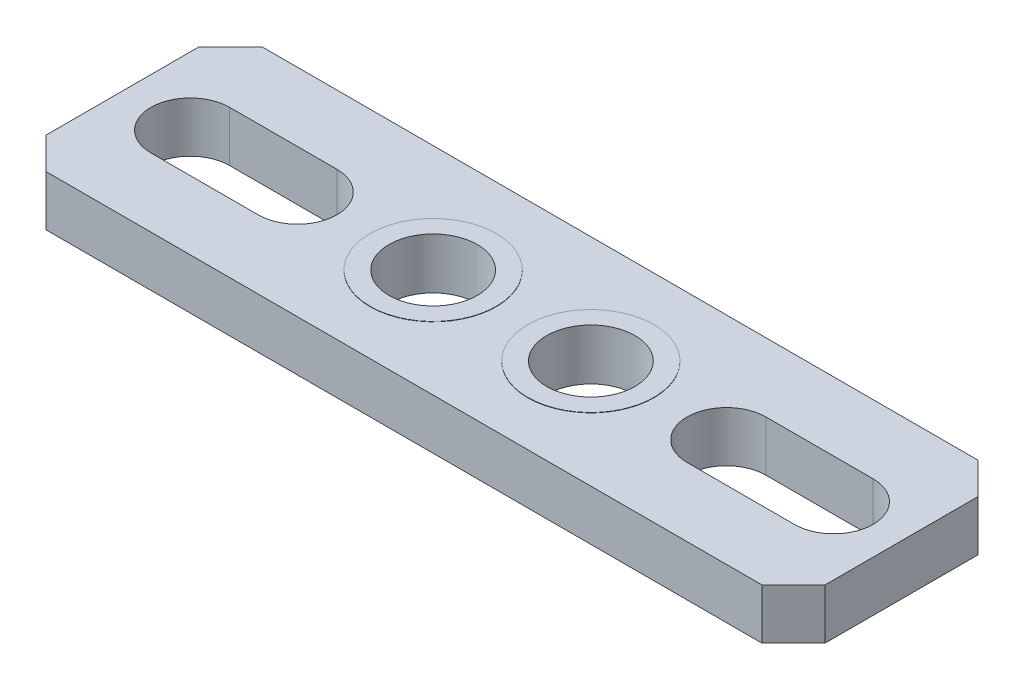
ISO-10303-21;
HEADER;
FILE_DESCRIPTION(('STEP AP214'),'2;1');
FILE_NAME('part.step','',(''),(''),'','','');
FILE_SCHEMA(('AUTOMOTIVE_DESIGN { 1 0 10303 214 1 1 1 1 }'));
ENDSEC;
DATA;
#1=APPLICATION_CONTEXT('core data for automotive mechanical design processes');
#2=APPLICATION_PROTOCOL_DEFINITION('international standard','automotive_design',2000,#1);
#3=PRODUCT_CONTEXT('',#1,'mechanical');
#4=PRODUCT('Part','Part','',(#3));
#5=PRODUCT_RELATED_PRODUCT_CATEGORY('part','',(#4));
#6=PRODUCT_DEFINITION_FORMATION('','',#4);
#7=PRODUCT_DEFINITION_CONTEXT('part definition',#1,'design');
#8=PRODUCT_DEFINITION('design','',#6,#7);
#9=PRODUCT_DEFINITION_SHAPE('','',#8);
#10=(LENGTH_UNIT() NAMED_UNIT(*) SI_UNIT(.MILLI.,.METRE.));
#11=(NAMED_UNIT(*) PLANE_ANGLE_UNIT() SI_UNIT($,.RADIAN.));
#12=(NAMED_UNIT(*) SI_UNIT($,.STERADIAN.) SOLID_ANGLE_UNIT());
#13=UNCERTAINTY_MEASURE_WITH_UNIT(LENGTH_MEASURE(1.E-05),#10,'distance_accuracy_value','');
#14=(GEOMETRIC_REPRESENTATION_CONTEXT(3) GLOBAL_UNCERTAINTY_ASSIGNED_CONTEXT((#13)) GLOBAL_UNIT_ASSIGNED_CONTEXT((#10,
#11,#12)) REPRESENTATION_CONTEXT('',''));
#15=CARTESIAN_POINT('',(0.,0.,0.));
#16=DIRECTION('',(0.,0.,1.));
#17=DIRECTION('',(1.,0.,0.));
#18=AXIS2_PLACEMENT_3D('',#15,#16,#17);
#19=CARTESIAN_POINT('',(0.,0.8,0.));
#20=DIRECTION('',(0.,1.,0.));
#21=DIRECTION('',(0.,0.,1.));
#22=AXIS2_PLACEMENT_3D('',#19,#20,#21);
#23=PLANE('',#22);
#24=CARTESIAN_POINT('',(-2.5,0.8,0.));
#25=DIRECTION('',(0.,1.,0.));
#26=DIRECTION('',(0.,0.,1.));
#27=AXIS2_PLACEMENT_3D('',#24,#25,#26);
#28=CIRCLE('',#27,2.);
#29=CARTESIAN_POINT('',(-2.5,0.8,2.));
#30=VERTEX_POINT('',#29);
#31=EDGE_CURVE('E700',#30,#30,#28,.T.);
#32=ORIENTED_EDGE('',*,*,#31,.F.);
#33=EDGE_LOOP('',(#32));
#34=FACE_BOUND('',#33,.T.);
#35=DIRECTION('',(-1.,0.,0.));
#36=VECTOR('',#35,1.);
#37=CARTESIAN_POINT('',(-12.35,0.8,-3.425));
#38=LINE('',#37,#36);
#39=CARTESIAN_POINT('',(11.35,0.8,-3.425));
#40=VERTEX_POINT('',#39);
#41=CARTESIAN_POINT('',(-11.35,0.8,-3.425));
#42=VERTEX_POINT('',#41);
#43=EDGE_CURVE('E259',#40,#42,#38,.T.);
#44=ORIENTED_EDGE('',*,*,#43,.T.);
#45=DIRECTION('',(0.707106781186549,0.,-0.707106781186546));
#46=VECTOR('',#45,1.);
#47=CARTESIAN_POINT('',(-7.38749999999997,0.8,-7.3875));
#48=LINE('',#47,#46);
#49=CARTESIAN_POINT('',(-12.35,0.8,-2.425));
#50=VERTEX_POINT('',#49);
#51=EDGE_CURVE('E317',#42,#50,#48,.F.);
#52=ORIENTED_EDGE('',*,*,#51,.T.);
#53=DIRECTION('',(0.,0.,1.));
#54=VECTOR('',#53,1.);
#55=CARTESIAN_POINT('',(-12.35,0.8,-3.425));
#56=LINE('',#55,#54);
#57=CARTESIAN_POINT('',(-12.35,0.8,2.42499999999999));
#58=VERTEX_POINT('',#57);
#59=EDGE_CURVE('E264',#50,#58,#56,.T.);
#60=ORIENTED_EDGE('',*,*,#59,.T.);
#61=DIRECTION('',(-0.707106781186546,0.,-0.707106781186549));
#62=VECTOR('',#61,1.);
#63=CARTESIAN_POINT('',(-7.38750000000002,0.8,7.38749999999999));
#64=LINE('',#63,#62);
#65=CARTESIAN_POINT('',(-11.35,0.8,3.425));
#66=VERTEX_POINT('',#65);
#67=EDGE_CURVE('E62',#58,#66,#64,.F.);
#68=ORIENTED_EDGE('',*,*,#67,.T.);
#69=DIRECTION('',(1.,0.,0.));
#70=VECTOR('',#69,1.);
#71=CARTESIAN_POINT('',(-12.35,0.8,3.425));
#72=LINE('',#71,#70);
#73=CARTESIAN_POINT('',(11.35,0.8,3.425));
#74=VERTEX_POINT('',#73);
#75=EDGE_CURVE('E267',#66,#74,#72,.T.);
#76=ORIENTED_EDGE('',*,*,#75,.T.);
#77=DIRECTION('',(-0.707106781186549,0.,0.707106781186546));
#78=VECTOR('',#77,1.);
#79=CARTESIAN_POINT('',(7.38749999999998,0.8,7.38750000000001));
#80=LINE('',#79,#78);
#81=CARTESIAN_POINT('',(12.35,0.8,2.425));
#82=VERTEX_POINT('',#81);
#83=EDGE_CURVE('E311',#74,#82,#80,.F.);
#84=ORIENTED_EDGE('',*,*,#83,.T.);
#85=DIRECTION('',(0.,0.,-1.));
#86=VECTOR('',#85,1.);
#87=CARTESIAN_POINT('',(12.35,0.8,-3.425));
#88=LINE('',#87,#86);
#89=CARTESIAN_POINT('',(12.35,0.8,-2.425));
#90=VERTEX_POINT('',#89);
#91=EDGE_CURVE('E255',#82,#90,#88,.T.);
#92=ORIENTED_EDGE('',*,*,#91,.T.);
#93=DIRECTION('',(0.707106781186546,0.,0.707106781186549));
#94=VECTOR('',#93,1.);
#95=CARTESIAN_POINT('',(7.38750000000002,0.8,-7.38749999999999));
#96=LINE('',#95,#94);
#97=EDGE_CURVE('E314',#90,#40,#96,.F.);
#98=ORIENTED_EDGE('',*,*,#97,.T.);
#99=EDGE_LOOP('',(#44,#52,#60,#68,#76,#84,#92,#98));
#100=FACE_BOUND('',#99,.T.);
#101=DIRECTION('',(1.,0.,0.));
#102=VECTOR('',#101,1.);
#103=CARTESIAN_POINT('',(-10.2,0.8,1.25));
#104=LINE('',#103,#102);
#105=CARTESIAN_POINT('',(-10.2,0.8,1.25));
#106=VERTEX_POINT('',#105);
#107=CARTESIAN_POINT('',(-6.8,0.8,1.25));
#108=VERTEX_POINT('',#107);
#109=EDGE_CURVE('E215',#106,#108,#104,.T.);
#110=ORIENTED_EDGE('',*,*,#109,.F.);
#111=CARTESIAN_POINT('',(-10.2,0.8,0.));
#112=DIRECTION('',(0.,1.,0.));
#113=DIRECTION('',(0.,0.,1.));
#114=AXIS2_PLACEMENT_3D('',#111,#112,#113);
#115=CIRCLE('',#114,1.25);
#116=CARTESIAN_POINT('',(-10.2,0.8,-1.25));
#117=VERTEX_POINT('',#116);
#118=EDGE_CURVE('E212',#117,#106,#115,.T.);
#119=ORIENTED_EDGE('',*,*,#118,.F.);
#120=DIRECTION('',(-1.,0.,0.));
#121=VECTOR('',#120,1.);
#122=CARTESIAN_POINT('',(-10.2,0.8,-1.25));
#123=LINE('',#122,#121);
#124=CARTESIAN_POINT('',(-6.8,0.8,-1.25));
#125=VERTEX_POINT('',#124);
#126=EDGE_CURVE('E223',#125,#117,#123,.T.);
#127=ORIENTED_EDGE('',*,*,#126,.F.);
#128=CARTESIAN_POINT('',(-6.8,0.8,0.));
#129=DIRECTION('',(0.,1.,0.));
#130=DIRECTION('',(0.,0.,1.));
#131=AXIS2_PLACEMENT_3D('',#128,#129,#130);
#132=CIRCLE('',#131,1.25);
#133=EDGE_CURVE('E219',#108,#125,#132,.T.);
#134=ORIENTED_EDGE('',*,*,#133,.F.);
#135=EDGE_LOOP('',(#110,#119,#127,#134));
#136=FACE_BOUND('',#135,.T.);
#137=DIRECTION('',(-1.,0.,0.));
#138=VECTOR('',#137,1.);
#139=CARTESIAN_POINT('',(10.2,0.8,-1.25));
#140=LINE('',#139,#138);
#141=CARTESIAN_POINT('',(10.2,0.8,-1.25));
#142=VERTEX_POINT('',#141);
#143=CARTESIAN_POINT('',(6.80000000000001,0.8,-1.25));
#144=VERTEX_POINT('',#143);
#145=EDGE_CURVE('E167',#142,#144,#140,.T.);
#146=ORIENTED_EDGE('',*,*,#145,.F.);
#147=CARTESIAN_POINT('',(10.2,0.8,0.));
#148=DIRECTION('',(0.,1.,0.));
#149=DIRECTION('',(0.,0.,-1.));
#150=AXIS2_PLACEMENT_3D('',#147,#148,#149);
#151=CIRCLE('',#150,1.25);
#152=CARTESIAN_POINT('',(10.2,0.8,1.25));
#153=VERTEX_POINT('',#152);
#154=EDGE_CURVE('E156',#153,#142,#151,.T.);
#155=ORIENTED_EDGE('',*,*,#154,.F.);
#156=DIRECTION('',(1.,0.,0.));
#157=VECTOR('',#156,1.);
#158=CARTESIAN_POINT('',(10.2,0.8,1.25));
#159=LINE('',#158,#157);
#160=CARTESIAN_POINT('',(6.80000000000001,0.8,1.25));
#161=VERTEX_POINT('',#160);
#162=EDGE_CURVE('E186',#161,#153,#159,.T.);
#163=ORIENTED_EDGE('',*,*,#162,.F.);
#164=CARTESIAN_POINT('',(6.80000000000001,0.8,0.));
#165=DIRECTION('',(0.,1.,0.));
#166=DIRECTION('',(0.,0.,-1.));
#167=AXIS2_PLACEMENT_3D('',#164,#165,#166);
#168=CIRCLE('',#167,1.25);
#169=EDGE_CURVE('E182',#144,#161,#168,.T.);
#170=ORIENTED_EDGE('',*,*,#169,.F.);
#171=EDGE_LOOP('',(#146,#155,#163,#170));
#172=FACE_BOUND('',#171,.T.);
#173=CARTESIAN_POINT('',(2.50000000000001,0.8,0.));
#174=DIRECTION('',(0.,1.,0.));
#175=DIRECTION('',(0.,0.,1.));
#176=AXIS2_PLACEMENT_3D('',#173,#174,#175);
#177=CIRCLE('',#176,2.);
#178=CARTESIAN_POINT('',(2.50000000000001,0.8,2.));
#179=VERTEX_POINT('',#178);
#180=EDGE_CURVE('E688',#179,#179,#177,.T.);
#181=ORIENTED_EDGE('',*,*,#180,.F.);
#182=EDGE_LOOP('',(#181));
#183=FACE_BOUND('',#182,.T.);
#184=ADVANCED_FACE('F41',(#34,#100,#136,#172,#183),#23,.T.);
#185=CARTESIAN_POINT('',(0.,-0.8,0.));
#186=DIRECTION('',(0.,1.,0.));
#187=DIRECTION('',(0.,0.,1.));
#188=AXIS2_PLACEMENT_3D('',#185,#186,#187);
#189=PLANE('',#188);
#190=CARTESIAN_POINT('',(2.50000000000001,-0.8,0.));
#191=DIRECTION('',(0.,1.,0.));
#192=DIRECTION('',(0.,0.,1.));
#193=AXIS2_PLACEMENT_3D('',#190,#191,#192);
#194=CIRCLE('',#193,2.);
#195=CARTESIAN_POINT('',(2.50000000000001,-0.8,2.));
#196=VERTEX_POINT('',#195);
#197=EDGE_CURVE('E666',#196,#196,#194,.T.);
#198=ORIENTED_EDGE('',*,*,#197,.T.);
#199=EDGE_LOOP('',(#198));
#200=FACE_BOUND('',#199,.T.);
#201=CARTESIAN_POINT('',(-2.5,-0.8,0.));
#202=DIRECTION('',(0.,1.,0.));
#203=DIRECTION('',(0.,0.,1.));
#204=AXIS2_PLACEMENT_3D('',#201,#202,#203);
#205=CIRCLE('',#204,2.);
#206=CARTESIAN_POINT('',(-2.5,-0.8,2.));
#207=VERTEX_POINT('',#206);
#208=EDGE_CURVE('E671',#207,#207,#205,.T.);
#209=ORIENTED_EDGE('',*,*,#208,.T.);
#210=EDGE_LOOP('',(#209));
#211=FACE_BOUND('',#210,.T.);
#212=CARTESIAN_POINT('',(-10.2,-0.8,0.));
#213=DIRECTION('',(0.,1.,0.));
#214=DIRECTION('',(0.,0.,1.));
#215=AXIS2_PLACEMENT_3D('',#212,#213,#214);
#216=CIRCLE('',#215,1.25);
#217=CARTESIAN_POINT('',(-10.2,-0.8,-1.25));
#218=VERTEX_POINT('',#217);
#219=CARTESIAN_POINT('',(-10.2,-0.8,1.25));
#220=VERTEX_POINT('',#219);
#221=EDGE_CURVE('E176',#218,#220,#216,.T.);
#222=ORIENTED_EDGE('',*,*,#221,.T.);
#223=DIRECTION('',(1.,0.,0.));
#224=VECTOR('',#223,1.);
#225=CARTESIAN_POINT('',(-10.2,-0.8,1.25));
#226=LINE('',#225,#224);
#227=CARTESIAN_POINT('',(-6.8,-0.8,1.25));
#228=VERTEX_POINT('',#227);
#229=EDGE_CURVE('E230',#220,#228,#226,.T.);
#230=ORIENTED_EDGE('',*,*,#229,.T.);
#231=CARTESIAN_POINT('',(-6.8,-0.8,0.));
#232=DIRECTION('',(0.,1.,0.));
#233=DIRECTION('',(0.,0.,1.));
#234=AXIS2_PLACEMENT_3D('',#231,#232,#233);
#235=CIRCLE('',#234,1.25);
#236=CARTESIAN_POINT('',(-6.8,-0.8,-1.25));
#237=VERTEX_POINT('',#236);
#238=EDGE_CURVE('E234',#228,#237,#235,.T.);
#239=ORIENTED_EDGE('',*,*,#238,.T.);
#240=DIRECTION('',(-1.,0.,0.));
#241=VECTOR('',#240,1.);
#242=CARTESIAN_POINT('',(-10.2,-0.8,-1.25));
#243=LINE('',#242,#241);
#244=EDGE_CURVE('E216',#237,#218,#243,.T.);
#245=ORIENTED_EDGE('',*,*,#244,.T.);
#246=EDGE_LOOP('',(#222,#230,#239,#245));
#247=FACE_BOUND('',#246,.T.);
#248=DIRECTION('',(0.,0.,1.));
#249=VECTOR('',#248,1.);
#250=CARTESIAN_POINT('',(-12.35,-0.8,-3.425));
#251=LINE('',#250,#249);
#252=CARTESIAN_POINT('',(-12.35,-0.8,-2.425));
#253=VERTEX_POINT('',#252);
#254=CARTESIAN_POINT('',(-12.35,-0.8,2.42499999999999));
#255=VERTEX_POINT('',#254);
#256=EDGE_CURVE('E278',#253,#255,#251,.T.);
#257=ORIENTED_EDGE('',*,*,#256,.F.);
#258=DIRECTION('',(-0.707106781186549,0.,0.707106781186546));
#259=VECTOR('',#258,1.);
#260=CARTESIAN_POINT('',(-12.35,-0.8,-2.425));
#261=LINE('',#260,#259);
#262=CARTESIAN_POINT('',(-11.35,-0.8,-3.425));
#263=VERTEX_POINT('',#262);
#264=EDGE_CURVE('E299',#253,#263,#261,.F.);
#265=ORIENTED_EDGE('',*,*,#264,.T.);
#266=DIRECTION('',(-1.,0.,0.));
#267=VECTOR('',#266,1.);
#268=CARTESIAN_POINT('',(-12.35,-0.8,-3.425));
#269=LINE('',#268,#267);
#270=CARTESIAN_POINT('',(11.35,-0.8,-3.425));
#271=VERTEX_POINT('',#270);
#272=EDGE_CURVE('E274',#271,#263,#269,.T.);
#273=ORIENTED_EDGE('',*,*,#272,.F.);
#274=DIRECTION('',(-0.707106781186546,0.,-0.707106781186549));
#275=VECTOR('',#274,1.);
#276=CARTESIAN_POINT('',(11.35,-0.8,-3.425));
#277=LINE('',#276,#275);
#278=CARTESIAN_POINT('',(12.35,-0.8,-2.425));
#279=VERTEX_POINT('',#278);
#280=EDGE_CURVE('E296',#271,#279,#277,.F.);
#281=ORIENTED_EDGE('',*,*,#280,.T.);
#282=DIRECTION('',(0.,0.,-1.));
#283=VECTOR('',#282,1.);
#284=CARTESIAN_POINT('',(12.35,-0.8,-3.425));
#285=LINE('',#284,#283);
#286=CARTESIAN_POINT('',(12.35,-0.8,2.425));
#287=VERTEX_POINT('',#286);
#288=EDGE_CURVE('E254',#287,#279,#285,.T.);
#289=ORIENTED_EDGE('',*,*,#288,.F.);
#290=DIRECTION('',(0.707106781186549,0.,-0.707106781186546));
#291=VECTOR('',#290,1.);
#292=CARTESIAN_POINT('',(12.35,-0.8,2.425));
#293=LINE('',#292,#291);
#294=CARTESIAN_POINT('',(11.35,-0.8,3.425));
#295=VERTEX_POINT('',#294);
#296=EDGE_CURVE('E293',#287,#295,#293,.F.);
#297=ORIENTED_EDGE('',*,*,#296,.T.);
#298=DIRECTION('',(1.,0.,0.));
#299=VECTOR('',#298,1.);
#300=CARTESIAN_POINT('',(-12.35,-0.8,3.425));
#301=LINE('',#300,#299);
#302=CARTESIAN_POINT('',(-11.35,-0.8,3.425));
#303=VERTEX_POINT('',#302);
#304=EDGE_CURVE('E260',#303,#295,#301,.T.);
#305=ORIENTED_EDGE('',*,*,#304,.F.);
#306=DIRECTION('',(0.707106781186546,0.,0.707106781186549));
#307=VECTOR('',#306,1.);
#308=CARTESIAN_POINT('',(-11.35,-0.8,3.425));
#309=LINE('',#308,#307);
#310=EDGE_CURVE('E290',#303,#255,#309,.F.);
#311=ORIENTED_EDGE('',*,*,#310,.T.);
#312=EDGE_LOOP('',(#257,#265,#273,#281,#289,#297,#305,#311));
#313=FACE_BOUND('',#312,.T.);
#314=CARTESIAN_POINT('',(10.2,-0.8,0.));
#315=DIRECTION('',(0.,1.,0.));
#316=DIRECTION('',(0.,0.,-1.));
#317=AXIS2_PLACEMENT_3D('',#314,#315,#316);
#318=CIRCLE('',#317,1.25);
#319=CARTESIAN_POINT('',(10.2,-0.8,1.25));
#320=VERTEX_POINT('',#319);
#321=CARTESIAN_POINT('',(10.2,-0.8,-1.25));
#322=VERTEX_POINT('',#321);
#323=EDGE_CURVE('E192',#320,#322,#318,.T.);
#324=ORIENTED_EDGE('',*,*,#323,.T.);
#325=DIRECTION('',(-1.,0.,0.));
#326=VECTOR('',#325,1.);
#327=CARTESIAN_POINT('',(10.2,-0.8,-1.25));
#328=LINE('',#327,#326);
#329=CARTESIAN_POINT('',(6.80000000000001,-0.8,-1.25));
#330=VERTEX_POINT('',#329);
#331=EDGE_CURVE('E174',#322,#330,#328,.T.);
#332=ORIENTED_EDGE('',*,*,#331,.T.);
#333=CARTESIAN_POINT('',(6.80000000000001,-0.8,0.));
#334=DIRECTION('',(0.,1.,0.));
#335=DIRECTION('',(0.,0.,-1.));
#336=AXIS2_PLACEMENT_3D('',#333,#334,#335);
#337=CIRCLE('',#336,1.25);
#338=CARTESIAN_POINT('',(6.80000000000001,-0.8,1.25));
#339=VERTEX_POINT('',#338);
#340=EDGE_CURVE('E198',#330,#339,#337,.T.);
#341=ORIENTED_EDGE('',*,*,#340,.T.);
#342=DIRECTION('',(1.,0.,0.));
#343=VECTOR('',#342,1.);
#344=CARTESIAN_POINT('',(10.2,-0.8,1.25));
#345=LINE('',#344,#343);
#346=EDGE_CURVE('E168',#339,#320,#345,.T.);
#347=ORIENTED_EDGE('',*,*,#346,.T.);
#348=EDGE_LOOP('',(#324,#332,#341,#347));
#349=FACE_BOUND('',#348,.T.);
#350=ADVANCED_FACE('F334',(#200,#211,#247,#313,#349),#189,.F.);
#351=CARTESIAN_POINT('',(12.35,0.8,-3.425));
#352=DIRECTION('',(-1.,0.,0.));
#353=DIRECTION('',(0.,0.,1.));
#354=AXIS2_PLACEMENT_3D('',#351,#352,#353);
#355=PLANE('',#354);
#356=ORIENTED_EDGE('',*,*,#288,.T.);
#357=DIRECTION('',(0.,1.,0.));
#358=VECTOR('',#357,1.);
#359=CARTESIAN_POINT('',(12.35,0.8,-2.425));
#360=LINE('',#359,#358);
#361=EDGE_CURVE('E324',#279,#90,#360,.T.);
#362=ORIENTED_EDGE('',*,*,#361,.T.);
#363=ORIENTED_EDGE('',*,*,#91,.F.);
#364=DIRECTION('',(0.,-1.,0.));
#365=VECTOR('',#364,1.);
#366=CARTESIAN_POINT('',(12.35,0.8,2.425));
#367=LINE('',#366,#365);
#368=EDGE_CURVE('E320',#82,#287,#367,.T.);
#369=ORIENTED_EDGE('',*,*,#368,.T.);
#370=EDGE_LOOP('',(#356,#362,#363,#369));
#371=FACE_BOUND('',#370,.T.);
#372=ADVANCED_FACE('F343',(#371),#355,.F.);
#373=CARTESIAN_POINT('',(-12.35,0.8,-3.425));
#374=DIRECTION('',(0.,0.,1.));
#375=DIRECTION('',(1.,0.,0.));
#376=AXIS2_PLACEMENT_3D('',#373,#374,#375);
#377=PLANE('',#376);
#378=ORIENTED_EDGE('',*,*,#272,.T.);
#379=DIRECTION('',(0.,1.,0.));
#380=VECTOR('',#379,1.);
#381=CARTESIAN_POINT('',(-11.35,0.8,-3.425));
#382=LINE('',#381,#380);
#383=EDGE_CURVE('E306',#263,#42,#382,.T.);
#384=ORIENTED_EDGE('',*,*,#383,.T.);
#385=ORIENTED_EDGE('',*,*,#43,.F.);
#386=DIRECTION('',(0.,-1.,0.));
#387=VECTOR('',#386,1.);
#388=CARTESIAN_POINT('',(11.35,0.8,-3.425));
#389=LINE('',#388,#387);
#390=EDGE_CURVE('E302',#40,#271,#389,.T.);
#391=ORIENTED_EDGE('',*,*,#390,.T.);
#392=EDGE_LOOP('',(#378,#384,#385,#391));
#393=FACE_BOUND('',#392,.T.);
#394=ADVANCED_FACE('F353',(#393),#377,.F.);
#395=CARTESIAN_POINT('',(-12.35,0.8,-3.425));
#396=DIRECTION('',(1.,0.,0.));
#397=DIRECTION('',(0.,0.,-1.));
#398=AXIS2_PLACEMENT_3D('',#395,#396,#397);
#399=PLANE('',#398);
#400=ORIENTED_EDGE('',*,*,#59,.F.);
#401=DIRECTION('',(0.,-1.,0.));
#402=VECTOR('',#401,1.);
#403=CARTESIAN_POINT('',(-12.35,0.8,-2.425));
#404=LINE('',#403,#402);
#405=EDGE_CURVE('E286',#50,#253,#404,.T.);
#406=ORIENTED_EDGE('',*,*,#405,.T.);
#407=ORIENTED_EDGE('',*,*,#256,.T.);
#408=DIRECTION('',(0.,1.,0.));
#409=VECTOR('',#408,1.);
#410=CARTESIAN_POINT('',(-12.35,0.8,2.425));
#411=LINE('',#410,#409);
#412=EDGE_CURVE('E270',#255,#58,#411,.T.);
#413=ORIENTED_EDGE('',*,*,#412,.T.);
#414=EDGE_LOOP('',(#400,#406,#407,#413));
#415=FACE_BOUND('',#414,.T.);
#416=ADVANCED_FACE('F361',(#415),#399,.F.);
#417=CARTESIAN_POINT('',(-12.35,0.8,3.425));
#418=DIRECTION('',(0.,0.,-1.));
#419=DIRECTION('',(-1.,0.,0.));
#420=AXIS2_PLACEMENT_3D('',#417,#418,#419);
#421=PLANE('',#420);
#422=ORIENTED_EDGE('',*,*,#304,.T.);
#423=DIRECTION('',(0.,1.,0.));
#424=VECTOR('',#423,1.);
#425=CARTESIAN_POINT('',(11.35,0.8,3.425));
#426=LINE('',#425,#424);
#427=EDGE_CURVE('E11',#295,#74,#426,.T.);
#428=ORIENTED_EDGE('',*,*,#427,.T.);
#429=ORIENTED_EDGE('',*,*,#75,.F.);
#430=DIRECTION('',(0.,-1.,0.));
#431=VECTOR('',#430,1.);
#432=CARTESIAN_POINT('',(-11.35,0.8,3.425));
#433=LINE('',#432,#431);
#434=EDGE_CURVE('E50',#66,#303,#433,.T.);
#435=ORIENTED_EDGE('',*,*,#434,.T.);
#436=EDGE_LOOP('',(#422,#428,#429,#435));
#437=FACE_BOUND('',#436,.T.);
#438=ADVANCED_FACE('F330',(#437),#421,.F.);
#439=CARTESIAN_POINT('',(-2.5,0.8,0.));
#440=DIRECTION('',(0.,-1.,0.));
#441=DIRECTION('',(0.,0.,-1.));
#442=AXIS2_PLACEMENT_3D('',#439,#440,#441);
#443=CYLINDRICAL_SURFACE('',#442,1.4);
#444=CARTESIAN_POINT('',(-2.5,0.81,0.));
#445=DIRECTION('',(0.,1.,0.));
#446=DIRECTION('',(0.,0.,1.));
#447=AXIS2_PLACEMENT_3D('',#444,#445,#446);
#448=CIRCLE('',#447,1.4);
#449=CARTESIAN_POINT('',(-2.5,0.81,1.4));
#450=VERTEX_POINT('',#449);
#451=EDGE_CURVE('E693',#450,#450,#448,.T.);
#452=ORIENTED_EDGE('',*,*,#451,.T.);
#453=EDGE_LOOP('',(#452));
#454=FACE_BOUND('',#453,.T.);
#455=CARTESIAN_POINT('',(-2.5,-0.81,0.));
#456=DIRECTION('',(0.,1.,0.));
#457=DIRECTION('',(0.,0.,1.));
#458=AXIS2_PLACEMENT_3D('',#455,#456,#457);
#459=CIRCLE('',#458,1.4);
#460=CARTESIAN_POINT('',(-2.5,-0.81,1.4));
#461=VERTEX_POINT('',#460);
#462=EDGE_CURVE('E665',#461,#461,#459,.T.);
#463=ORIENTED_EDGE('',*,*,#462,.F.);
#464=EDGE_LOOP('',(#463));
#465=FACE_BOUND('',#464,.T.);
#466=ADVANCED_FACE('F382',(#454,#465),#443,.F.);
#467=CARTESIAN_POINT('',(2.50000000000001,0.8,0.));
#468=DIRECTION('',(0.,-1.,0.));
#469=DIRECTION('',(0.,0.,-1.));
#470=AXIS2_PLACEMENT_3D('',#467,#468,#469);
#471=CYLINDRICAL_SURFACE('',#470,1.4);
#472=CARTESIAN_POINT('',(2.50000000000001,0.81,0.));
#473=DIRECTION('',(0.,1.,0.));
#474=DIRECTION('',(0.,0.,1.));
#475=AXIS2_PLACEMENT_3D('',#472,#473,#474);
#476=CIRCLE('',#475,1.4);
#477=CARTESIAN_POINT('',(2.50000000000001,0.81,1.4));
#478=VERTEX_POINT('',#477);
#479=EDGE_CURVE('E681',#478,#478,#476,.T.);
#480=ORIENTED_EDGE('',*,*,#479,.T.);
#481=EDGE_LOOP('',(#480));
#482=FACE_BOUND('',#481,.T.);
#483=CARTESIAN_POINT('',(2.50000000000001,-0.81,0.));
#484=DIRECTION('',(0.,1.,0.));
#485=DIRECTION('',(0.,0.,1.));
#486=AXIS2_PLACEMENT_3D('',#483,#484,#485);
#487=CIRCLE('',#486,1.4);
#488=CARTESIAN_POINT('',(2.50000000000001,-0.81,1.4));
#489=VERTEX_POINT('',#488);
#490=EDGE_CURVE('E660',#489,#489,#487,.T.);
#491=ORIENTED_EDGE('',*,*,#490,.F.);
#492=EDGE_LOOP('',(#491));
#493=FACE_BOUND('',#492,.T.);
#494=ADVANCED_FACE('F470',(#482,#493),#471,.F.);
#495=CARTESIAN_POINT('',(-10.2,0.8,0.));
#496=DIRECTION('',(0.,-1.,0.));
#497=DIRECTION('',(0.,0.,-1.));
#498=AXIS2_PLACEMENT_3D('',#495,#496,#497);
#499=CYLINDRICAL_SURFACE('',#498,1.25);
#500=ORIENTED_EDGE('',*,*,#221,.F.);
#501=DIRECTION('',(0.,-1.,0.));
#502=VECTOR('',#501,1.);
#503=CARTESIAN_POINT('',(-10.2,0.8,-1.25));
#504=LINE('',#503,#502);
#505=EDGE_CURVE('E226',#117,#218,#504,.T.);
#506=ORIENTED_EDGE('',*,*,#505,.F.);
#507=ORIENTED_EDGE('',*,*,#118,.T.);
#508=DIRECTION('',(0.,-1.,0.));
#509=VECTOR('',#508,1.);
#510=CARTESIAN_POINT('',(-10.2,0.8,1.25));
#511=LINE('',#510,#509);
#512=EDGE_CURVE('E250',#106,#220,#511,.T.);
#513=ORIENTED_EDGE('',*,*,#512,.T.);
#514=EDGE_LOOP('',(#500,#506,#507,#513));
#515=FACE_BOUND('',#514,.T.);
#516=ADVANCED_FACE('F481',(#515),#499,.F.);
#517=CARTESIAN_POINT('',(-10.2,0.8,1.25));
#518=DIRECTION('',(0.,0.,-1.));
#519=DIRECTION('',(-1.,0.,0.));
#520=AXIS2_PLACEMENT_3D('',#517,#518,#519);
#521=PLANE('',#520);
#522=ORIENTED_EDGE('',*,*,#229,.F.);
#523=ORIENTED_EDGE('',*,*,#512,.F.);
#524=ORIENTED_EDGE('',*,*,#109,.T.);
#525=DIRECTION('',(0.,-1.,0.));
#526=VECTOR('',#525,1.);
#527=CARTESIAN_POINT('',(-6.8,0.8,1.25));
#528=LINE('',#527,#526);
#529=EDGE_CURVE('E247',#108,#228,#528,.T.);
#530=ORIENTED_EDGE('',*,*,#529,.T.);
#531=EDGE_LOOP('',(#522,#523,#524,#530));
#532=FACE_BOUND('',#531,.T.);
#533=ADVANCED_FACE('F551',(#532),#521,.T.);
#534=CARTESIAN_POINT('',(-6.8,0.8,0.));
#535=DIRECTION('',(0.,-1.,0.));
#536=DIRECTION('',(0.,0.,-1.));
#537=AXIS2_PLACEMENT_3D('',#534,#535,#536);
#538=CYLINDRICAL_SURFACE('',#537,1.25);
#539=ORIENTED_EDGE('',*,*,#238,.F.);
#540=ORIENTED_EDGE('',*,*,#529,.F.);
#541=ORIENTED_EDGE('',*,*,#133,.T.);
#542=DIRECTION('',(0.,-1.,0.));
#543=VECTOR('',#542,1.);
#544=CARTESIAN_POINT('',(-6.8,0.8,-1.25));
#545=LINE('',#544,#543);
#546=EDGE_CURVE('E244',#125,#237,#545,.T.);
#547=ORIENTED_EDGE('',*,*,#546,.T.);
#548=EDGE_LOOP('',(#539,#540,#541,#547));
#549=FACE_BOUND('',#548,.T.);
#550=ADVANCED_FACE('F547',(#549),#538,.F.);
#551=CARTESIAN_POINT('',(-10.2,0.8,-1.25));
#552=DIRECTION('',(0.,0.,1.));
#553=DIRECTION('',(1.,0.,0.));
#554=AXIS2_PLACEMENT_3D('',#551,#552,#553);
#555=PLANE('',#554);
#556=ORIENTED_EDGE('',*,*,#244,.F.);
#557=ORIENTED_EDGE('',*,*,#546,.F.);
#558=ORIENTED_EDGE('',*,*,#126,.T.);
#559=ORIENTED_EDGE('',*,*,#505,.T.);
#560=EDGE_LOOP('',(#556,#557,#558,#559));
#561=FACE_BOUND('',#560,.T.);
#562=ADVANCED_FACE('F544',(#561),#555,.T.);
#563=CARTESIAN_POINT('',(10.2,0.8,0.));
#564=DIRECTION('',(0.,-1.,0.));
#565=DIRECTION('',(0.,0.,-1.));
#566=AXIS2_PLACEMENT_3D('',#563,#564,#565);
#567=CYLINDRICAL_SURFACE('',#566,1.25);
#568=ORIENTED_EDGE('',*,*,#323,.F.);
#569=DIRECTION('',(0.,-1.,0.));
#570=VECTOR('',#569,1.);
#571=CARTESIAN_POINT('',(10.2,0.8,1.25));
#572=LINE('',#571,#570);
#573=EDGE_CURVE('E162',#153,#320,#572,.T.);
#574=ORIENTED_EDGE('',*,*,#573,.F.);
#575=ORIENTED_EDGE('',*,*,#154,.T.);
#576=DIRECTION('',(0.,-1.,0.));
#577=VECTOR('',#576,1.);
#578=CARTESIAN_POINT('',(10.2,0.8,-1.25));
#579=LINE('',#578,#577);
#580=EDGE_CURVE('E159',#142,#322,#579,.T.);
#581=ORIENTED_EDGE('',*,*,#580,.T.);
#582=EDGE_LOOP('',(#568,#574,#575,#581));
#583=FACE_BOUND('',#582,.T.);
#584=ADVANCED_FACE('F158',(#583),#567,.F.);
#585=CARTESIAN_POINT('',(10.2,0.8,-1.25));
#586=DIRECTION('',(0.,0.,1.));
#587=DIRECTION('',(1.,0.,0.));
#588=AXIS2_PLACEMENT_3D('',#585,#586,#587);
#589=PLANE('',#588);
#590=ORIENTED_EDGE('',*,*,#331,.F.);
#591=ORIENTED_EDGE('',*,*,#580,.F.);
#592=ORIENTED_EDGE('',*,*,#145,.T.);
#593=DIRECTION('',(0.,-1.,0.));
#594=VECTOR('',#593,1.);
#595=CARTESIAN_POINT('',(6.80000000000001,0.8,-1.25));
#596=LINE('',#595,#594);
#597=EDGE_CURVE('E177',#144,#330,#596,.T.);
#598=ORIENTED_EDGE('',*,*,#597,.T.);
#599=EDGE_LOOP('',(#590,#591,#592,#598));
#600=FACE_BOUND('',#599,.T.);
#601=ADVANCED_FACE('F171',(#600),#589,.T.);
#602=CARTESIAN_POINT('',(6.80000000000001,0.8,0.));
#603=DIRECTION('',(0.,-1.,0.));
#604=DIRECTION('',(0.,0.,-1.));
#605=AXIS2_PLACEMENT_3D('',#602,#603,#604);
#606=CYLINDRICAL_SURFACE('',#605,1.25);
#607=ORIENTED_EDGE('',*,*,#340,.F.);
#608=ORIENTED_EDGE('',*,*,#597,.F.);
#609=ORIENTED_EDGE('',*,*,#169,.T.);
#610=DIRECTION('',(0.,-1.,0.));
#611=VECTOR('',#610,1.);
#612=CARTESIAN_POINT('',(6.80000000000001,0.8,1.25));
#613=LINE('',#612,#611);
#614=EDGE_CURVE('E207',#161,#339,#613,.T.);
#615=ORIENTED_EDGE('',*,*,#614,.T.);
#616=EDGE_LOOP('',(#607,#608,#609,#615));
#617=FACE_BOUND('',#616,.T.);
#618=ADVANCED_FACE('F535',(#617),#606,.F.);
#619=CARTESIAN_POINT('',(10.2,0.8,1.25));
#620=DIRECTION('',(0.,0.,-1.));
#621=DIRECTION('',(-1.,0.,0.));
#622=AXIS2_PLACEMENT_3D('',#619,#620,#621);
#623=PLANE('',#622);
#624=ORIENTED_EDGE('',*,*,#346,.F.);
#625=ORIENTED_EDGE('',*,*,#614,.F.);
#626=ORIENTED_EDGE('',*,*,#162,.T.);
#627=ORIENTED_EDGE('',*,*,#573,.T.);
#628=EDGE_LOOP('',(#624,#625,#626,#627));
#629=FACE_BOUND('',#628,.T.);
#630=ADVANCED_FACE('F395',(#629),#623,.T.);
#631=CARTESIAN_POINT('',(-12.35,0.8,-2.425));
#632=DIRECTION('',(0.707106781186546,0.,0.707106781186549));
#633=DIRECTION('',(0.,-1.,0.));
#634=AXIS2_PLACEMENT_3D('',#631,#632,#633);
#635=PLANE('',#634);
#636=ORIENTED_EDGE('',*,*,#51,.F.);
#637=ORIENTED_EDGE('',*,*,#383,.F.);
#638=ORIENTED_EDGE('',*,*,#264,.F.);
#639=ORIENTED_EDGE('',*,*,#405,.F.);
#640=EDGE_LOOP('',(#636,#637,#638,#639));
#641=FACE_BOUND('',#640,.T.);
#642=ADVANCED_FACE('F358',(#641),#635,.F.);
#643=CARTESIAN_POINT('',(11.35,0.8,-3.425));
#644=DIRECTION('',(-0.707106781186549,0.,0.707106781186546));
#645=DIRECTION('',(0.,-1.,0.));
#646=AXIS2_PLACEMENT_3D('',#643,#644,#645);
#647=PLANE('',#646);
#648=ORIENTED_EDGE('',*,*,#97,.F.);
#649=ORIENTED_EDGE('',*,*,#361,.F.);
#650=ORIENTED_EDGE('',*,*,#280,.F.);
#651=ORIENTED_EDGE('',*,*,#390,.F.);
#652=EDGE_LOOP('',(#648,#649,#650,#651));
#653=FACE_BOUND('',#652,.T.);
#654=ADVANCED_FACE('F350',(#653),#647,.F.);
#655=CARTESIAN_POINT('',(12.35,0.8,2.425));
#656=DIRECTION('',(-0.707106781186546,0.,-0.707106781186549));
#657=DIRECTION('',(0.,-1.,0.));
#658=AXIS2_PLACEMENT_3D('',#655,#656,#657);
#659=PLANE('',#658);
#660=ORIENTED_EDGE('',*,*,#83,.F.);
#661=ORIENTED_EDGE('',*,*,#427,.F.);
#662=ORIENTED_EDGE('',*,*,#296,.F.);
#663=ORIENTED_EDGE('',*,*,#368,.F.);
#664=EDGE_LOOP('',(#660,#661,#662,#663));
#665=FACE_BOUND('',#664,.T.);
#666=ADVANCED_FACE('F340',(#665),#659,.F.);
#667=CARTESIAN_POINT('',(-11.35,0.8,3.425));
#668=DIRECTION('',(0.707106781186549,0.,-0.707106781186546));
#669=DIRECTION('',(0.,-1.,0.));
#670=AXIS2_PLACEMENT_3D('',#667,#668,#669);
#671=PLANE('',#670);
#672=ORIENTED_EDGE('',*,*,#67,.F.);
#673=ORIENTED_EDGE('',*,*,#412,.F.);
#674=ORIENTED_EDGE('',*,*,#310,.F.);
#675=ORIENTED_EDGE('',*,*,#434,.F.);
#676=EDGE_LOOP('',(#672,#673,#674,#675));
#677=FACE_BOUND('',#676,.T.);
#678=ADVANCED_FACE('F43',(#677),#671,.F.);
#679=CARTESIAN_POINT('',(-2.5,0.81,0.));
#680=DIRECTION('',(0.,1.,0.));
#681=DIRECTION('',(0.,0.,1.));
#682=AXIS2_PLACEMENT_3D('',#679,#680,#681);
#683=PLANE('',#682);
#684=CARTESIAN_POINT('',(-2.5,0.81,0.));
#685=DIRECTION('',(0.,1.,0.));
#686=DIRECTION('',(0.,0.,1.));
#687=AXIS2_PLACEMENT_3D('',#684,#685,#686);
#688=CIRCLE('',#687,2.);
#689=CARTESIAN_POINT('',(-2.5,0.81,2.));
#690=VERTEX_POINT('',#689);
#691=EDGE_CURVE('E195',#690,#690,#688,.T.);
#692=ORIENTED_EDGE('',*,*,#691,.T.);
#693=EDGE_LOOP('',(#692));
#694=FACE_BOUND('',#693,.T.);
#695=ORIENTED_EDGE('',*,*,#451,.F.);
#696=EDGE_LOOP('',(#695));
#697=FACE_BOUND('',#696,.T.);
#698=ADVANCED_FACE('F364',(#694,#697),#683,.T.);
#699=CARTESIAN_POINT('',(-2.5,0.81,0.));
#700=DIRECTION('',(0.,-1.,0.));
#701=DIRECTION('',(0.,0.,-1.));
#702=AXIS2_PLACEMENT_3D('',#699,#700,#701);
#703=CYLINDRICAL_SURFACE('',#702,2.);
#704=ORIENTED_EDGE('',*,*,#691,.F.);
#705=EDGE_LOOP('',(#704));
#706=FACE_BOUND('',#705,.T.);
#707=ORIENTED_EDGE('',*,*,#31,.T.);
#708=EDGE_LOOP('',(#707));
#709=FACE_BOUND('',#708,.T.);
#710=ADVANCED_FACE('F369',(#706,#709),#703,.T.);
#711=CARTESIAN_POINT('',(2.50000000000001,0.81,0.));
#712=DIRECTION('',(0.,1.,0.));
#713=DIRECTION('',(0.,0.,1.));
#714=AXIS2_PLACEMENT_3D('',#711,#712,#713);
#715=PLANE('',#714);
#716=CARTESIAN_POINT('',(2.50000000000001,0.81,0.));
#717=DIRECTION('',(0.,1.,0.));
#718=DIRECTION('',(0.,0.,1.));
#719=AXIS2_PLACEMENT_3D('',#716,#717,#718);
#720=CIRCLE('',#719,2.);
#721=CARTESIAN_POINT('',(2.50000000000001,0.81,2.));
#722=VERTEX_POINT('',#721);
#723=EDGE_CURVE('E689',#722,#722,#720,.T.);
#724=ORIENTED_EDGE('',*,*,#723,.T.);
#725=EDGE_LOOP('',(#724));
#726=FACE_BOUND('',#725,.T.);
#727=ORIENTED_EDGE('',*,*,#479,.F.);
#728=EDGE_LOOP('',(#727));
#729=FACE_BOUND('',#728,.T.);
#730=ADVANCED_FACE('F431',(#726,#729),#715,.T.);
#731=CARTESIAN_POINT('',(2.50000000000001,0.81,0.));
#732=DIRECTION('',(0.,-1.,0.));
#733=DIRECTION('',(0.,0.,-1.));
#734=AXIS2_PLACEMENT_3D('',#731,#732,#733);
#735=CYLINDRICAL_SURFACE('',#734,2.);
#736=ORIENTED_EDGE('',*,*,#723,.F.);
#737=EDGE_LOOP('',(#736));
#738=FACE_BOUND('',#737,.T.);
#739=ORIENTED_EDGE('',*,*,#180,.T.);
#740=EDGE_LOOP('',(#739));
#741=FACE_BOUND('',#740,.T.);
#742=ADVANCED_FACE('F441',(#738,#741),#735,.T.);
#743=CARTESIAN_POINT('',(-2.5,-0.81,0.));
#744=DIRECTION('',(0.,1.,0.));
#745=DIRECTION('',(0.,0.,1.));
#746=AXIS2_PLACEMENT_3D('',#743,#744,#745);
#747=CYLINDRICAL_SURFACE('',#746,2.);
#748=CARTESIAN_POINT('',(-2.5,-0.81,0.));
#749=DIRECTION('',(0.,1.,0.));
#750=DIRECTION('',(0.,0.,1.));
#751=AXIS2_PLACEMENT_3D('',#748,#749,#750);
#752=CIRCLE('',#751,2.);
#753=CARTESIAN_POINT('',(-2.5,-0.81,2.));
#754=VERTEX_POINT('',#753);
#755=EDGE_CURVE('E677',#754,#754,#752,.T.);
#756=ORIENTED_EDGE('',*,*,#755,.T.);
#757=EDGE_LOOP('',(#756));
#758=FACE_BOUND('',#757,.T.);
#759=ORIENTED_EDGE('',*,*,#208,.F.);
#760=EDGE_LOOP('',(#759));
#761=FACE_BOUND('',#760,.T.);
#762=ADVANCED_FACE('F451',(#758,#761),#747,.T.);
#763=CARTESIAN_POINT('',(-2.5,-0.81,0.));
#764=DIRECTION('',(0.,-1.,0.));
#765=DIRECTION('',(0.,0.,1.));
#766=AXIS2_PLACEMENT_3D('',#763,#764,#765);
#767=PLANE('',#766);
#768=ORIENTED_EDGE('',*,*,#462,.T.);
#769=EDGE_LOOP('',(#768));
#770=FACE_BOUND('',#769,.T.);
#771=ORIENTED_EDGE('',*,*,#755,.F.);
#772=EDGE_LOOP('',(#771));
#773=FACE_BOUND('',#772,.T.);
#774=ADVANCED_FACE('F491',(#770,#773),#767,.T.);
#775=CARTESIAN_POINT('',(2.50000000000001,-0.81,0.));
#776=DIRECTION('',(0.,1.,0.));
#777=DIRECTION('',(0.,0.,1.));
#778=AXIS2_PLACEMENT_3D('',#775,#776,#777);
#779=CYLINDRICAL_SURFACE('',#778,2.);
#780=CARTESIAN_POINT('',(2.50000000000001,-0.81,0.));
#781=DIRECTION('',(0.,1.,0.));
#782=DIRECTION('',(0.,0.,1.));
#783=AXIS2_PLACEMENT_3D('',#780,#781,#782);
#784=CIRCLE('',#783,2.);
#785=CARTESIAN_POINT('',(2.50000000000001,-0.81,2.));
#786=VERTEX_POINT('',#785);
#787=EDGE_CURVE('E663',#786,#786,#784,.T.);
#788=ORIENTED_EDGE('',*,*,#787,.T.);
#789=EDGE_LOOP('',(#788));
#790=FACE_BOUND('',#789,.T.);
#791=ORIENTED_EDGE('',*,*,#197,.F.);
#792=EDGE_LOOP('',(#791));
#793=FACE_BOUND('',#792,.T.);
#794=ADVANCED_FACE('F503',(#790,#793),#779,.T.);
#795=CARTESIAN_POINT('',(2.50000000000001,-0.81,0.));
#796=DIRECTION('',(0.,-1.,0.));
#797=DIRECTION('',(0.,0.,1.));
#798=AXIS2_PLACEMENT_3D('',#795,#796,#797);
#799=PLANE('',#798);
#800=ORIENTED_EDGE('',*,*,#490,.T.);
#801=EDGE_LOOP('',(#800));
#802=FACE_BOUND('',#801,.T.);
#803=ORIENTED_EDGE('',*,*,#787,.F.);
#804=EDGE_LOOP('',(#803));
#805=FACE_BOUND('',#804,.T.);
#806=ADVANCED_FACE('F513',(#802,#805),#799,.T.);
#807=CLOSED_SHELL('',(#184,#350,#372,#394,#416,#438,#466,#494,#516,#533,#550,#562,#584,#601,
#618,#630,#642,#654,#666,#678,#698,#710,#730,#742,#762,#774,#794,#806));
#808=MANIFOLD_SOLID_BREP('B2',#807);
#809=ADVANCED_BREP_SHAPE_REPRESENTATION('',(#18,#808),#14);
#810=SHAPE_DEFINITION_REPRESENTATION(#9,#809);
ENDSEC;
END-ISO-10303-21;
